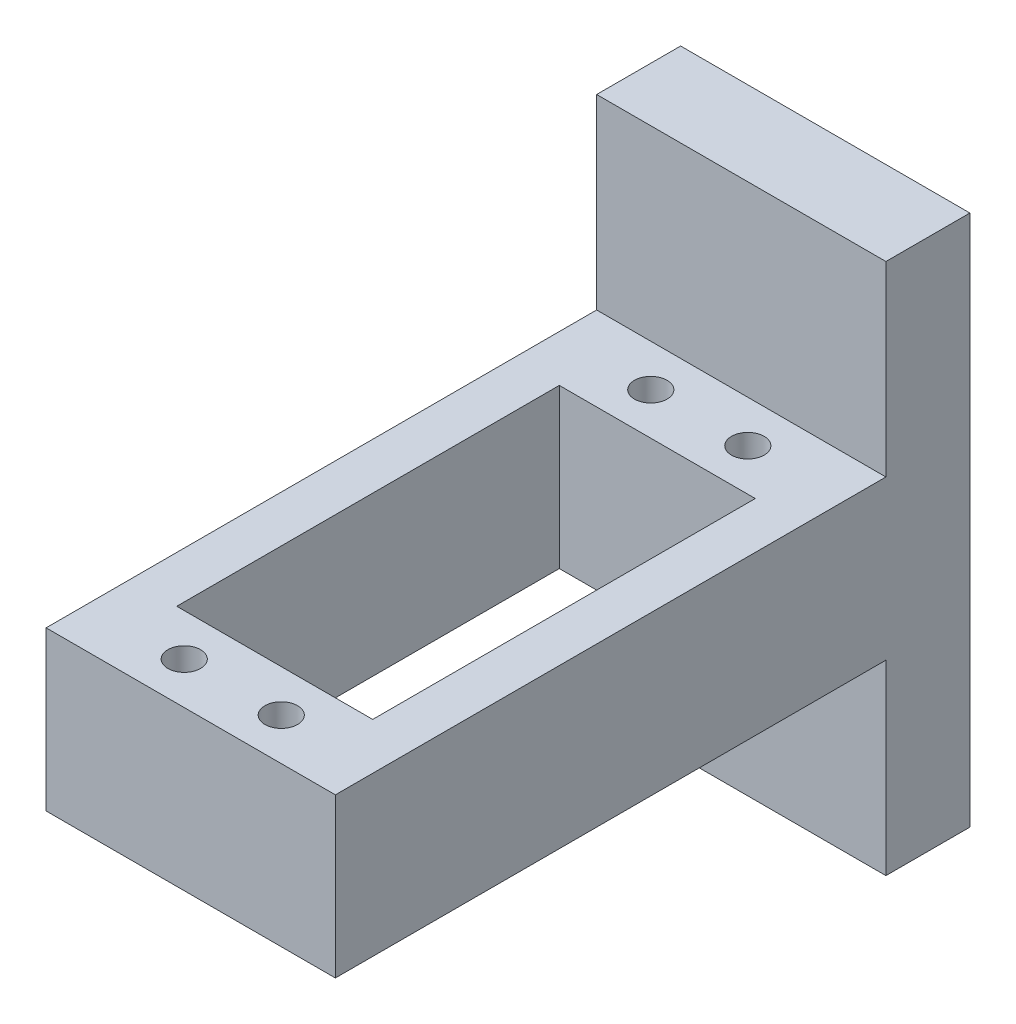
ISO-10303-21;
HEADER;
FILE_DESCRIPTION(('STEP AP214'),'2;1');
FILE_NAME('part.step','',(''),(''),'','','');
FILE_SCHEMA(('AUTOMOTIVE_DESIGN { 1 0 10303 214 1 1 1 1 }'));
ENDSEC;
DATA;
#1=APPLICATION_CONTEXT('core data for automotive mechanical design processes');
#2=APPLICATION_PROTOCOL_DEFINITION('international standard','automotive_design',2000,#1);
#3=PRODUCT_CONTEXT('',#1,'mechanical');
#4=PRODUCT('Part','Part','',(#3));
#5=PRODUCT_RELATED_PRODUCT_CATEGORY('part','',(#4));
#6=PRODUCT_DEFINITION_FORMATION('','',#4);
#7=PRODUCT_DEFINITION_CONTEXT('part definition',#1,'design');
#8=PRODUCT_DEFINITION('design','',#6,#7);
#9=PRODUCT_DEFINITION_SHAPE('','',#8);
#10=(LENGTH_UNIT() NAMED_UNIT(*) SI_UNIT(.MILLI.,.METRE.));
#11=(NAMED_UNIT(*) PLANE_ANGLE_UNIT() SI_UNIT($,.RADIAN.));
#12=(NAMED_UNIT(*) SI_UNIT($,.STERADIAN.) SOLID_ANGLE_UNIT());
#13=UNCERTAINTY_MEASURE_WITH_UNIT(LENGTH_MEASURE(1.E-05),#10,'distance_accuracy_value','');
#14=(GEOMETRIC_REPRESENTATION_CONTEXT(3) GLOBAL_UNCERTAINTY_ASSIGNED_CONTEXT((#13)) GLOBAL_UNIT_ASSIGNED_CONTEXT((#10,
#11,#12)) REPRESENTATION_CONTEXT('',''));
#15=CARTESIAN_POINT('',(0.,0.,0.));
#16=DIRECTION('',(0.,0.,1.));
#17=DIRECTION('',(1.,0.,0.));
#18=AXIS2_PLACEMENT_3D('',#15,#16,#17);
#19=CARTESIAN_POINT('',(0.,0.,9.));
#20=DIRECTION('',(0.,0.,1.));
#21=DIRECTION('',(1.,0.,0.));
#22=AXIS2_PLACEMENT_3D('',#19,#20,#21);
#23=PLANE('',#22);
#24=DIRECTION('',(-1.,0.,0.));
#25=VECTOR('',#24,1.);
#26=CARTESIAN_POINT('',(15.5,8.5,9.));
#27=LINE('',#26,#25);
#28=CARTESIAN_POINT('',(15.5,8.49999999999999,9.));
#29=VERTEX_POINT('',#28);
#30=CARTESIAN_POINT('',(-15.5,8.5,9.));
#31=VERTEX_POINT('',#30);
#32=EDGE_CURVE('E157',#29,#31,#27,.T.);
#33=ORIENTED_EDGE('',*,*,#32,.F.);
#34=DIRECTION('',(0.,1.,0.));
#35=VECTOR('',#34,1.);
#36=CARTESIAN_POINT('',(15.5,-28.5,9.));
#37=LINE('',#36,#35);
#38=CARTESIAN_POINT('',(15.5,28.5,9.));
#39=VERTEX_POINT('',#38);
#40=EDGE_CURVE('E185',#29,#39,#37,.T.);
#41=ORIENTED_EDGE('',*,*,#40,.T.);
#42=DIRECTION('',(-1.,0.,0.));
#43=VECTOR('',#42,1.);
#44=CARTESIAN_POINT('',(15.5,28.5,9.));
#45=LINE('',#44,#43);
#46=CARTESIAN_POINT('',(-15.5,28.5,9.));
#47=VERTEX_POINT('',#46);
#48=EDGE_CURVE('E188',#39,#47,#45,.T.);
#49=ORIENTED_EDGE('',*,*,#48,.T.);
#50=DIRECTION('',(0.,-1.,0.));
#51=VECTOR('',#50,1.);
#52=CARTESIAN_POINT('',(-15.5,10.3,9.));
#53=LINE('',#52,#51);
#54=EDGE_CURVE('E180',#47,#31,#53,.T.);
#55=ORIENTED_EDGE('',*,*,#54,.T.);
#56=EDGE_LOOP('',(#33,#41,#49,#55));
#57=FACE_BOUND('',#56,.T.);
#58=ADVANCED_FACE('F33',(#57),#23,.T.);
#59=CARTESIAN_POINT('',(-15.5,-28.5,9.));
#60=DIRECTION('',(1.,0.,0.));
#61=DIRECTION('',(0.,0.,-1.));
#62=AXIS2_PLACEMENT_3D('',#59,#60,#61);
#63=PLANE('',#62);
#64=DIRECTION('',(0.,-1.,0.));
#65=VECTOR('',#64,1.);
#66=CARTESIAN_POINT('',(-15.5,-28.5,0.));
#67=LINE('',#66,#65);
#68=CARTESIAN_POINT('',(-15.5,28.5,0.));
#69=VERTEX_POINT('',#68);
#70=CARTESIAN_POINT('',(-15.5,-28.5,0.));
#71=VERTEX_POINT('',#70);
#72=EDGE_CURVE('E179',#69,#71,#67,.T.);
#73=ORIENTED_EDGE('',*,*,#72,.T.);
#74=DIRECTION('',(0.,0.,-1.));
#75=VECTOR('',#74,1.);
#76=CARTESIAN_POINT('',(-15.5,-28.5,9.));
#77=LINE('',#76,#75);
#78=CARTESIAN_POINT('',(-15.5,-28.5,9.));
#79=VERTEX_POINT('',#78);
#80=EDGE_CURVE('E207',#79,#71,#77,.T.);
#81=ORIENTED_EDGE('',*,*,#80,.F.);
#82=CARTESIAN_POINT('',(-15.5,-8.5,9.));
#83=VERTEX_POINT('',#82);
#84=EDGE_CURVE('E183',#83,#79,#53,.T.);
#85=ORIENTED_EDGE('',*,*,#84,.F.);
#86=DIRECTION('',(0.,0.,-1.));
#87=VECTOR('',#86,1.);
#88=CARTESIAN_POINT('',(-15.5,-8.5,68.));
#89=LINE('',#88,#87);
#90=CARTESIAN_POINT('',(-15.5,-8.5,68.));
#91=VERTEX_POINT('',#90);
#92=EDGE_CURVE('E176',#91,#83,#89,.T.);
#93=ORIENTED_EDGE('',*,*,#92,.F.);
#94=DIRECTION('',(0.,-1.,0.));
#95=VECTOR('',#94,1.);
#96=CARTESIAN_POINT('',(-15.5,-8.5,68.));
#97=LINE('',#96,#95);
#98=CARTESIAN_POINT('',(-15.5,8.5,68.));
#99=VERTEX_POINT('',#98);
#100=EDGE_CURVE('E153',#99,#91,#97,.T.);
#101=ORIENTED_EDGE('',*,*,#100,.F.);
#102=DIRECTION('',(0.,0.,-1.));
#103=VECTOR('',#102,1.);
#104=CARTESIAN_POINT('',(-15.5,8.5,68.));
#105=LINE('',#104,#103);
#106=EDGE_CURVE('E163',#99,#31,#105,.T.);
#107=ORIENTED_EDGE('',*,*,#106,.T.);
#108=ORIENTED_EDGE('',*,*,#54,.F.);
#109=DIRECTION('',(0.,0.,-1.));
#110=VECTOR('',#109,1.);
#111=CARTESIAN_POINT('',(-15.5,28.5,9.));
#112=LINE('',#111,#110);
#113=EDGE_CURVE('E190',#47,#69,#112,.T.);
#114=ORIENTED_EDGE('',*,*,#113,.T.);
#115=EDGE_LOOP('',(#73,#81,#85,#93,#101,#107,#108,#114));
#116=FACE_BOUND('',#115,.T.);
#117=ADVANCED_FACE('F35',(#116),#63,.F.);
#118=CARTESIAN_POINT('',(15.5,-28.5,9.));
#119=DIRECTION('',(0.,1.,0.));
#120=DIRECTION('',(0.,0.,1.));
#121=AXIS2_PLACEMENT_3D('',#118,#119,#120);
#122=PLANE('',#121);
#123=DIRECTION('',(1.,0.,0.));
#124=VECTOR('',#123,1.);
#125=CARTESIAN_POINT('',(15.5,-28.5,0.));
#126=LINE('',#125,#124);
#127=CARTESIAN_POINT('',(15.5,-28.5,0.));
#128=VERTEX_POINT('',#127);
#129=EDGE_CURVE('E192',#71,#128,#126,.T.);
#130=ORIENTED_EDGE('',*,*,#129,.T.);
#131=DIRECTION('',(0.,0.,-1.));
#132=VECTOR('',#131,1.);
#133=CARTESIAN_POINT('',(15.5,-28.5,9.));
#134=LINE('',#133,#132);
#135=CARTESIAN_POINT('',(15.5,-28.5,9.));
#136=VERTEX_POINT('',#135);
#137=EDGE_CURVE('E204',#136,#128,#134,.T.);
#138=ORIENTED_EDGE('',*,*,#137,.F.);
#139=DIRECTION('',(1.,0.,0.));
#140=VECTOR('',#139,1.);
#141=CARTESIAN_POINT('',(15.5,-28.5,9.));
#142=LINE('',#141,#140);
#143=EDGE_CURVE('E182',#79,#136,#142,.T.);
#144=ORIENTED_EDGE('',*,*,#143,.F.);
#145=ORIENTED_EDGE('',*,*,#80,.T.);
#146=EDGE_LOOP('',(#130,#138,#144,#145));
#147=FACE_BOUND('',#146,.T.);
#148=ADVANCED_FACE('F311',(#147),#122,.F.);
#149=CARTESIAN_POINT('',(15.5,-28.5,9.));
#150=DIRECTION('',(-1.,0.,0.));
#151=DIRECTION('',(0.,0.,1.));
#152=AXIS2_PLACEMENT_3D('',#149,#150,#151);
#153=PLANE('',#152);
#154=DIRECTION('',(0.,1.,0.));
#155=VECTOR('',#154,1.);
#156=CARTESIAN_POINT('',(15.5,-28.5,0.));
#157=LINE('',#156,#155);
#158=CARTESIAN_POINT('',(15.5,28.5,0.));
#159=VERTEX_POINT('',#158);
#160=EDGE_CURVE('E194',#128,#159,#157,.T.);
#161=ORIENTED_EDGE('',*,*,#160,.T.);
#162=DIRECTION('',(0.,0.,-1.));
#163=VECTOR('',#162,1.);
#164=CARTESIAN_POINT('',(15.5,28.5,9.));
#165=LINE('',#164,#163);
#166=EDGE_CURVE('E201',#39,#159,#165,.T.);
#167=ORIENTED_EDGE('',*,*,#166,.F.);
#168=ORIENTED_EDGE('',*,*,#40,.F.);
#169=DIRECTION('',(0.,0.,-1.));
#170=VECTOR('',#169,1.);
#171=CARTESIAN_POINT('',(15.5,8.5,68.));
#172=LINE('',#171,#170);
#173=CARTESIAN_POINT('',(15.5,8.5,68.));
#174=VERTEX_POINT('',#173);
#175=EDGE_CURVE('E170',#174,#29,#172,.T.);
#176=ORIENTED_EDGE('',*,*,#175,.F.);
#177=DIRECTION('',(0.,1.,0.));
#178=VECTOR('',#177,1.);
#179=CARTESIAN_POINT('',(15.5,-8.5,68.));
#180=LINE('',#179,#178);
#181=CARTESIAN_POINT('',(15.5,-8.5,68.));
#182=VERTEX_POINT('',#181);
#183=EDGE_CURVE('E159',#182,#174,#180,.T.);
#184=ORIENTED_EDGE('',*,*,#183,.F.);
#185=DIRECTION('',(0.,0.,-1.));
#186=VECTOR('',#185,1.);
#187=CARTESIAN_POINT('',(15.5,-8.5,68.));
#188=LINE('',#187,#186);
#189=CARTESIAN_POINT('',(15.5,-8.5,9.));
#190=VERTEX_POINT('',#189);
#191=EDGE_CURVE('E173',#182,#190,#188,.T.);
#192=ORIENTED_EDGE('',*,*,#191,.T.);
#193=EDGE_CURVE('E186',#136,#190,#37,.T.);
#194=ORIENTED_EDGE('',*,*,#193,.F.);
#195=ORIENTED_EDGE('',*,*,#137,.T.);
#196=EDGE_LOOP('',(#161,#167,#168,#176,#184,#192,#194,#195));
#197=FACE_BOUND('',#196,.T.);
#198=ADVANCED_FACE('F306',(#197),#153,.F.);
#199=CARTESIAN_POINT('',(15.5,28.5,9.));
#200=DIRECTION('',(0.,-1.,0.));
#201=DIRECTION('',(0.,0.,-1.));
#202=AXIS2_PLACEMENT_3D('',#199,#200,#201);
#203=PLANE('',#202);
#204=DIRECTION('',(-1.,0.,0.));
#205=VECTOR('',#204,1.);
#206=CARTESIAN_POINT('',(15.5,28.5,0.));
#207=LINE('',#206,#205);
#208=EDGE_CURVE('E196',#159,#69,#207,.T.);
#209=ORIENTED_EDGE('',*,*,#208,.T.);
#210=ORIENTED_EDGE('',*,*,#113,.F.);
#211=ORIENTED_EDGE('',*,*,#48,.F.);
#212=ORIENTED_EDGE('',*,*,#166,.T.);
#213=EDGE_LOOP('',(#209,#210,#211,#212));
#214=FACE_BOUND('',#213,.T.);
#215=ADVANCED_FACE('F292',(#214),#203,.F.);
#216=DIRECTION('',(1.,0.,0.));
#217=VECTOR('',#216,1.);
#218=CARTESIAN_POINT('',(15.5,-8.5,9.));
#219=LINE('',#218,#217);
#220=EDGE_CURVE('E150',#83,#190,#219,.T.);
#221=ORIENTED_EDGE('',*,*,#220,.F.);
#222=ORIENTED_EDGE('',*,*,#84,.T.);
#223=ORIENTED_EDGE('',*,*,#143,.T.);
#224=ORIENTED_EDGE('',*,*,#193,.T.);
#225=EDGE_LOOP('',(#221,#222,#223,#224));
#226=FACE_BOUND('',#225,.T.);
#227=ADVANCED_FACE('F277',(#226),#23,.T.);
#228=CARTESIAN_POINT('',(0.,0.,0.));
#229=DIRECTION('',(0.,0.,1.));
#230=DIRECTION('',(1.,0.,0.));
#231=AXIS2_PLACEMENT_3D('',#228,#229,#230);
#232=PLANE('',#231);
#233=CARTESIAN_POINT('',(11.5,25.,0.));
#234=DIRECTION('',(0.,0.,-1.));
#235=DIRECTION('',(1.,0.,0.));
#236=AXIS2_PLACEMENT_3D('',#233,#234,#235);
#237=CIRCLE('',#236,1.75);
#238=CARTESIAN_POINT('',(13.25,25.,0.));
#239=VERTEX_POINT('',#238);
#240=EDGE_CURVE('E259',#239,#239,#237,.T.);
#241=ORIENTED_EDGE('',*,*,#240,.F.);
#242=EDGE_LOOP('',(#241));
#243=FACE_BOUND('',#242,.T.);
#244=CARTESIAN_POINT('',(-11.5,-25.,0.));
#245=DIRECTION('',(0.,0.,-1.));
#246=DIRECTION('',(1.,0.,0.));
#247=AXIS2_PLACEMENT_3D('',#244,#245,#246);
#248=CIRCLE('',#247,1.75);
#249=CARTESIAN_POINT('',(-9.75000000000002,-25.,0.));
#250=VERTEX_POINT('',#249);
#251=EDGE_CURVE('E253',#250,#250,#248,.T.);
#252=ORIENTED_EDGE('',*,*,#251,.F.);
#253=EDGE_LOOP('',(#252));
#254=FACE_BOUND('',#253,.T.);
#255=CARTESIAN_POINT('',(11.5,-25.,0.));
#256=DIRECTION('',(0.,0.,-1.));
#257=DIRECTION('',(-1.,0.,0.));
#258=AXIS2_PLACEMENT_3D('',#255,#256,#257);
#259=CIRCLE('',#258,1.75);
#260=CARTESIAN_POINT('',(9.74999999999998,-25.,0.));
#261=VERTEX_POINT('',#260);
#262=EDGE_CURVE('E247',#261,#261,#259,.T.);
#263=ORIENTED_EDGE('',*,*,#262,.F.);
#264=EDGE_LOOP('',(#263));
#265=FACE_BOUND('',#264,.T.);
#266=CARTESIAN_POINT('',(-11.5,25.,0.));
#267=DIRECTION('',(0.,0.,-1.));
#268=DIRECTION('',(-1.,0.,0.));
#269=AXIS2_PLACEMENT_3D('',#266,#267,#268);
#270=CIRCLE('',#269,1.75);
#271=CARTESIAN_POINT('',(-13.25,25.,0.));
#272=VERTEX_POINT('',#271);
#273=EDGE_CURVE('E241',#272,#272,#270,.T.);
#274=ORIENTED_EDGE('',*,*,#273,.F.);
#275=EDGE_LOOP('',(#274));
#276=FACE_BOUND('',#275,.T.);
#277=ORIENTED_EDGE('',*,*,#72,.F.);
#278=ORIENTED_EDGE('',*,*,#208,.F.);
#279=ORIENTED_EDGE('',*,*,#160,.F.);
#280=ORIENTED_EDGE('',*,*,#129,.F.);
#281=EDGE_LOOP('',(#277,#278,#279,#280));
#282=FACE_BOUND('',#281,.T.);
#283=ADVANCED_FACE('F274',(#243,#254,#265,#276,#282),#232,.F.);
#284=CARTESIAN_POINT('',(15.5,-8.5,68.));
#285=DIRECTION('',(0.,1.,0.));
#286=DIRECTION('',(0.,0.,1.));
#287=AXIS2_PLACEMENT_3D('',#284,#285,#286);
#288=PLANE('',#287);
#289=CARTESIAN_POINT('',(5.2,-8.5,13.5));
#290=DIRECTION('',(0.,-1.,0.));
#291=DIRECTION('',(0.,0.,-1.));
#292=AXIS2_PLACEMENT_3D('',#289,#290,#291);
#293=CIRCLE('',#292,1.75);
#294=CARTESIAN_POINT('',(5.2,-8.5,11.75));
#295=VERTEX_POINT('',#294);
#296=EDGE_CURVE('E219',#295,#295,#293,.T.);
#297=ORIENTED_EDGE('',*,*,#296,.F.);
#298=EDGE_LOOP('',(#297));
#299=FACE_BOUND('',#298,.T.);
#300=CARTESIAN_POINT('',(-5.2,-8.5,13.5));
#301=DIRECTION('',(0.,-1.,0.));
#302=DIRECTION('',(0.,0.,1.));
#303=AXIS2_PLACEMENT_3D('',#300,#301,#302);
#304=CIRCLE('',#303,1.75);
#305=CARTESIAN_POINT('',(-5.2,-8.5,15.25));
#306=VERTEX_POINT('',#305);
#307=EDGE_CURVE('E236',#306,#306,#304,.T.);
#308=ORIENTED_EDGE('',*,*,#307,.F.);
#309=EDGE_LOOP('',(#308));
#310=FACE_BOUND('',#309,.T.);
#311=CARTESIAN_POINT('',(5.2,-8.5,63.5));
#312=DIRECTION('',(0.,-1.,0.));
#313=DIRECTION('',(0.,0.,1.));
#314=AXIS2_PLACEMENT_3D('',#311,#312,#313);
#315=CIRCLE('',#314,1.75);
#316=CARTESIAN_POINT('',(5.2,-8.5,65.25));
#317=VERTEX_POINT('',#316);
#318=EDGE_CURVE('E232',#317,#317,#315,.T.);
#319=ORIENTED_EDGE('',*,*,#318,.F.);
#320=EDGE_LOOP('',(#319));
#321=FACE_BOUND('',#320,.T.);
#322=CARTESIAN_POINT('',(-5.2,-8.5,63.5));
#323=DIRECTION('',(0.,-1.,0.));
#324=DIRECTION('',(0.,0.,-1.));
#325=AXIS2_PLACEMENT_3D('',#322,#323,#324);
#326=CIRCLE('',#325,1.75);
#327=CARTESIAN_POINT('',(-5.2,-8.5,61.75));
#328=VERTEX_POINT('',#327);
#329=EDGE_CURVE('E229',#328,#328,#326,.T.);
#330=ORIENTED_EDGE('',*,*,#329,.F.);
#331=EDGE_LOOP('',(#330));
#332=FACE_BOUND('',#331,.T.);
#333=DIRECTION('',(-1.,0.,0.));
#334=VECTOR('',#333,1.);
#335=CARTESIAN_POINT('',(-10.5,-8.5,59.));
#336=LINE('',#335,#334);
#337=CARTESIAN_POINT('',(10.5,-8.5,59.));
#338=VERTEX_POINT('',#337);
#339=CARTESIAN_POINT('',(-10.5,-8.5,59.));
#340=VERTEX_POINT('',#339);
#341=EDGE_CURVE('E136',#338,#340,#336,.T.);
#342=ORIENTED_EDGE('',*,*,#341,.F.);
#343=DIRECTION('',(0.,0.,1.));
#344=VECTOR('',#343,1.);
#345=CARTESIAN_POINT('',(10.5,-8.5,18.));
#346=LINE('',#345,#344);
#347=CARTESIAN_POINT('',(10.5,-8.5,18.));
#348=VERTEX_POINT('',#347);
#349=EDGE_CURVE('E50',#348,#338,#346,.T.);
#350=ORIENTED_EDGE('',*,*,#349,.F.);
#351=DIRECTION('',(1.,0.,0.));
#352=VECTOR('',#351,1.);
#353=CARTESIAN_POINT('',(-10.5,-8.5,18.));
#354=LINE('',#353,#352);
#355=CARTESIAN_POINT('',(-10.5,-8.5,18.));
#356=VERTEX_POINT('',#355);
#357=EDGE_CURVE('E143',#356,#348,#354,.T.);
#358=ORIENTED_EDGE('',*,*,#357,.F.);
#359=DIRECTION('',(0.,0.,-1.));
#360=VECTOR('',#359,1.);
#361=CARTESIAN_POINT('',(-10.5,-8.5,18.));
#362=LINE('',#361,#360);
#363=EDGE_CURVE('E127',#340,#356,#362,.T.);
#364=ORIENTED_EDGE('',*,*,#363,.F.);
#365=EDGE_LOOP('',(#342,#350,#358,#364));
#366=FACE_BOUND('',#365,.T.);
#367=ORIENTED_EDGE('',*,*,#220,.T.);
#368=ORIENTED_EDGE('',*,*,#191,.F.);
#369=DIRECTION('',(1.,0.,0.));
#370=VECTOR('',#369,1.);
#371=CARTESIAN_POINT('',(15.5,-8.5,68.));
#372=LINE('',#371,#370);
#373=EDGE_CURVE('E156',#91,#182,#372,.T.);
#374=ORIENTED_EDGE('',*,*,#373,.F.);
#375=ORIENTED_EDGE('',*,*,#92,.T.);
#376=EDGE_LOOP('',(#367,#368,#374,#375));
#377=FACE_BOUND('',#376,.T.);
#378=ADVANCED_FACE('F140',(#299,#310,#321,#332,#366,#377),#288,.F.);
#379=CARTESIAN_POINT('',(15.5,8.5,68.));
#380=DIRECTION('',(0.,-1.,0.));
#381=DIRECTION('',(1.,0.,0.));
#382=AXIS2_PLACEMENT_3D('',#379,#380,#381);
#383=PLANE('',#382);
#384=CARTESIAN_POINT('',(5.2,8.5,13.5));
#385=DIRECTION('',(0.,-1.,0.));
#386=DIRECTION('',(1.,0.,0.));
#387=AXIS2_PLACEMENT_3D('',#384,#385,#386);
#388=CIRCLE('',#387,1.75);
#389=CARTESIAN_POINT('',(6.95,8.5,13.5));
#390=VERTEX_POINT('',#389);
#391=EDGE_CURVE('E37',#390,#390,#388,.T.);
#392=ORIENTED_EDGE('',*,*,#391,.T.);
#393=EDGE_LOOP('',(#392));
#394=FACE_BOUND('',#393,.T.);
#395=CARTESIAN_POINT('',(-5.2,8.5,13.5));
#396=DIRECTION('',(0.,-1.,0.));
#397=DIRECTION('',(1.,0.,0.));
#398=AXIS2_PLACEMENT_3D('',#395,#396,#397);
#399=CIRCLE('',#398,1.75);
#400=CARTESIAN_POINT('',(-3.45,8.5,13.5));
#401=VERTEX_POINT('',#400);
#402=EDGE_CURVE('E221',#401,#401,#399,.T.);
#403=ORIENTED_EDGE('',*,*,#402,.T.);
#404=EDGE_LOOP('',(#403));
#405=FACE_BOUND('',#404,.T.);
#406=CARTESIAN_POINT('',(5.2,8.5,63.5));
#407=DIRECTION('',(0.,-1.,0.));
#408=DIRECTION('',(1.,0.,0.));
#409=AXIS2_PLACEMENT_3D('',#406,#407,#408);
#410=CIRCLE('',#409,1.75);
#411=CARTESIAN_POINT('',(6.95,8.5,63.5));
#412=VERTEX_POINT('',#411);
#413=EDGE_CURVE('E218',#412,#412,#410,.T.);
#414=ORIENTED_EDGE('',*,*,#413,.T.);
#415=EDGE_LOOP('',(#414));
#416=FACE_BOUND('',#415,.T.);
#417=CARTESIAN_POINT('',(-5.2,8.5,63.5));
#418=DIRECTION('',(0.,-1.,0.));
#419=DIRECTION('',(1.,0.,0.));
#420=AXIS2_PLACEMENT_3D('',#417,#418,#419);
#421=CIRCLE('',#420,1.75);
#422=CARTESIAN_POINT('',(-3.45,8.5,63.5));
#423=VERTEX_POINT('',#422);
#424=EDGE_CURVE('E215',#423,#423,#421,.T.);
#425=ORIENTED_EDGE('',*,*,#424,.T.);
#426=EDGE_LOOP('',(#425));
#427=FACE_BOUND('',#426,.T.);
#428=DIRECTION('',(1.,0.,0.));
#429=VECTOR('',#428,1.);
#430=CARTESIAN_POINT('',(15.5,8.5,18.));
#431=LINE('',#430,#429);
#432=CARTESIAN_POINT('',(-10.5,8.5,18.));
#433=VERTEX_POINT('',#432);
#434=CARTESIAN_POINT('',(10.5,8.5,18.));
#435=VERTEX_POINT('',#434);
#436=EDGE_CURVE('E42',#433,#435,#431,.T.);
#437=ORIENTED_EDGE('',*,*,#436,.T.);
#438=DIRECTION('',(0.,0.,1.));
#439=VECTOR('',#438,1.);
#440=CARTESIAN_POINT('',(10.5,8.5,68.));
#441=LINE('',#440,#439);
#442=CARTESIAN_POINT('',(10.5,8.5,59.));
#443=VERTEX_POINT('',#442);
#444=EDGE_CURVE('E11',#435,#443,#441,.T.);
#445=ORIENTED_EDGE('',*,*,#444,.T.);
#446=DIRECTION('',(-1.,0.,0.));
#447=VECTOR('',#446,1.);
#448=CARTESIAN_POINT('',(15.5,8.5,59.));
#449=LINE('',#448,#447);
#450=CARTESIAN_POINT('',(-10.5,8.5,59.));
#451=VERTEX_POINT('',#450);
#452=EDGE_CURVE('E210',#443,#451,#449,.T.);
#453=ORIENTED_EDGE('',*,*,#452,.T.);
#454=DIRECTION('',(0.,0.,-1.));
#455=VECTOR('',#454,1.);
#456=CARTESIAN_POINT('',(-10.5,8.5,68.));
#457=LINE('',#456,#455);
#458=EDGE_CURVE('E130',#451,#433,#457,.T.);
#459=ORIENTED_EDGE('',*,*,#458,.T.);
#460=EDGE_LOOP('',(#437,#445,#453,#459));
#461=FACE_BOUND('',#460,.T.);
#462=ORIENTED_EDGE('',*,*,#32,.T.);
#463=ORIENTED_EDGE('',*,*,#106,.F.);
#464=DIRECTION('',(-1.,0.,0.));
#465=VECTOR('',#464,1.);
#466=CARTESIAN_POINT('',(15.5,8.5,68.));
#467=LINE('',#466,#465);
#468=EDGE_CURVE('E161',#174,#99,#467,.T.);
#469=ORIENTED_EDGE('',*,*,#468,.F.);
#470=ORIENTED_EDGE('',*,*,#175,.T.);
#471=EDGE_LOOP('',(#462,#463,#469,#470));
#472=FACE_BOUND('',#471,.T.);
#473=ADVANCED_FACE('F301',(#394,#405,#416,#427,#461,#472),#383,.F.);
#474=CARTESIAN_POINT('',(0.,0.,68.));
#475=DIRECTION('',(0.,0.,1.));
#476=DIRECTION('',(1.,0.,0.));
#477=AXIS2_PLACEMENT_3D('',#474,#475,#476);
#478=PLANE('',#477);
#479=ORIENTED_EDGE('',*,*,#100,.T.);
#480=ORIENTED_EDGE('',*,*,#373,.T.);
#481=ORIENTED_EDGE('',*,*,#183,.T.);
#482=ORIENTED_EDGE('',*,*,#468,.T.);
#483=EDGE_LOOP('',(#479,#480,#481,#482));
#484=FACE_BOUND('',#483,.T.);
#485=ADVANCED_FACE('F317',(#484),#478,.T.);
#486=CARTESIAN_POINT('',(10.5,28.5,18.));
#487=DIRECTION('',(1.,0.,0.));
#488=DIRECTION('',(0.,0.,-1.));
#489=AXIS2_PLACEMENT_3D('',#486,#487,#488);
#490=PLANE('',#489);
#491=DIRECTION('',(0.,-1.,0.));
#492=VECTOR('',#491,1.);
#493=CARTESIAN_POINT('',(10.5,28.5,18.));
#494=LINE('',#493,#492);
#495=EDGE_CURVE('E148',#435,#348,#494,.T.);
#496=ORIENTED_EDGE('',*,*,#495,.T.);
#497=ORIENTED_EDGE('',*,*,#349,.T.);
#498=DIRECTION('',(0.,-1.,0.));
#499=VECTOR('',#498,1.);
#500=CARTESIAN_POINT('',(10.5,28.5,59.));
#501=LINE('',#500,#499);
#502=EDGE_CURVE('E133',#443,#338,#501,.T.);
#503=ORIENTED_EDGE('',*,*,#502,.F.);
#504=ORIENTED_EDGE('',*,*,#444,.F.);
#505=EDGE_LOOP('',(#496,#497,#503,#504));
#506=FACE_BOUND('',#505,.T.);
#507=ADVANCED_FACE('F319',(#506),#490,.F.);
#508=CARTESIAN_POINT('',(-10.5,28.5,18.));
#509=DIRECTION('',(0.,0.,-1.));
#510=DIRECTION('',(-1.,0.,0.));
#511=AXIS2_PLACEMENT_3D('',#508,#509,#510);
#512=PLANE('',#511);
#513=DIRECTION('',(0.,-1.,0.));
#514=VECTOR('',#513,1.);
#515=CARTESIAN_POINT('',(-10.5,28.5,18.));
#516=LINE('',#515,#514);
#517=EDGE_CURVE('E132',#433,#356,#516,.T.);
#518=ORIENTED_EDGE('',*,*,#517,.T.);
#519=ORIENTED_EDGE('',*,*,#357,.T.);
#520=ORIENTED_EDGE('',*,*,#495,.F.);
#521=ORIENTED_EDGE('',*,*,#436,.F.);
#522=EDGE_LOOP('',(#518,#519,#520,#521));
#523=FACE_BOUND('',#522,.T.);
#524=ADVANCED_FACE('F325',(#523),#512,.F.);
#525=CARTESIAN_POINT('',(-10.5,28.5,18.));
#526=DIRECTION('',(-1.,0.,0.));
#527=DIRECTION('',(0.,0.,1.));
#528=AXIS2_PLACEMENT_3D('',#525,#526,#527);
#529=PLANE('',#528);
#530=DIRECTION('',(0.,-1.,0.));
#531=VECTOR('',#530,1.);
#532=CARTESIAN_POINT('',(-10.5,28.5,59.));
#533=LINE('',#532,#531);
#534=EDGE_CURVE('E58',#451,#340,#533,.T.);
#535=ORIENTED_EDGE('',*,*,#534,.T.);
#536=ORIENTED_EDGE('',*,*,#363,.T.);
#537=ORIENTED_EDGE('',*,*,#517,.F.);
#538=ORIENTED_EDGE('',*,*,#458,.F.);
#539=EDGE_LOOP('',(#535,#536,#537,#538));
#540=FACE_BOUND('',#539,.T.);
#541=ADVANCED_FACE('F124',(#540),#529,.F.);
#542=CARTESIAN_POINT('',(-10.5,28.5,59.));
#543=DIRECTION('',(0.,0.,1.));
#544=DIRECTION('',(1.,0.,0.));
#545=AXIS2_PLACEMENT_3D('',#542,#543,#544);
#546=PLANE('',#545);
#547=ORIENTED_EDGE('',*,*,#502,.T.);
#548=ORIENTED_EDGE('',*,*,#341,.T.);
#549=ORIENTED_EDGE('',*,*,#534,.F.);
#550=ORIENTED_EDGE('',*,*,#452,.F.);
#551=EDGE_LOOP('',(#547,#548,#549,#550));
#552=FACE_BOUND('',#551,.T.);
#553=ADVANCED_FACE('F137',(#552),#546,.F.);
#554=CARTESIAN_POINT('',(-5.2,28.5,63.5));
#555=DIRECTION('',(0.,-1.,0.));
#556=DIRECTION('',(0.,0.,-1.));
#557=AXIS2_PLACEMENT_3D('',#554,#555,#556);
#558=CYLINDRICAL_SURFACE('',#557,1.75);
#559=ORIENTED_EDGE('',*,*,#329,.T.);
#560=EDGE_LOOP('',(#559));
#561=FACE_BOUND('',#560,.T.);
#562=ORIENTED_EDGE('',*,*,#424,.F.);
#563=EDGE_LOOP('',(#562));
#564=FACE_BOUND('',#563,.T.);
#565=ADVANCED_FACE('F411',(#561,#564),#558,.F.);
#566=CARTESIAN_POINT('',(5.2,28.5,63.5));
#567=DIRECTION('',(0.,-1.,0.));
#568=DIRECTION('',(0.,0.,-1.));
#569=AXIS2_PLACEMENT_3D('',#566,#567,#568);
#570=CYLINDRICAL_SURFACE('',#569,1.75);
#571=ORIENTED_EDGE('',*,*,#318,.T.);
#572=EDGE_LOOP('',(#571));
#573=FACE_BOUND('',#572,.T.);
#574=ORIENTED_EDGE('',*,*,#413,.F.);
#575=EDGE_LOOP('',(#574));
#576=FACE_BOUND('',#575,.T.);
#577=ADVANCED_FACE('F420',(#573,#576),#570,.F.);
#578=CARTESIAN_POINT('',(-5.2,28.5,13.5));
#579=DIRECTION('',(0.,-1.,0.));
#580=DIRECTION('',(0.,0.,-1.));
#581=AXIS2_PLACEMENT_3D('',#578,#579,#580);
#582=CYLINDRICAL_SURFACE('',#581,1.75);
#583=ORIENTED_EDGE('',*,*,#307,.T.);
#584=EDGE_LOOP('',(#583));
#585=FACE_BOUND('',#584,.T.);
#586=ORIENTED_EDGE('',*,*,#402,.F.);
#587=EDGE_LOOP('',(#586));
#588=FACE_BOUND('',#587,.T.);
#589=ADVANCED_FACE('F430',(#585,#588),#582,.F.);
#590=CARTESIAN_POINT('',(5.2,28.5,13.5));
#591=DIRECTION('',(0.,-1.,0.));
#592=DIRECTION('',(0.,0.,-1.));
#593=AXIS2_PLACEMENT_3D('',#590,#591,#592);
#594=CYLINDRICAL_SURFACE('',#593,1.75);
#595=ORIENTED_EDGE('',*,*,#296,.T.);
#596=EDGE_LOOP('',(#595));
#597=FACE_BOUND('',#596,.T.);
#598=ORIENTED_EDGE('',*,*,#391,.F.);
#599=EDGE_LOOP('',(#598));
#600=FACE_BOUND('',#599,.T.);
#601=ADVANCED_FACE('F440',(#597,#600),#594,.F.);
#602=CARTESIAN_POINT('',(-11.5,25.,3.));
#603=DIRECTION('',(0.,0.,-1.));
#604=DIRECTION('',(-1.,0.,0.));
#605=AXIS2_PLACEMENT_3D('',#602,#603,#604);
#606=CYLINDRICAL_SURFACE('',#605,1.75);
#607=CARTESIAN_POINT('',(-11.5,25.,3.));
#608=DIRECTION('',(0.,0.,-1.));
#609=DIRECTION('',(-1.,0.,0.));
#610=AXIS2_PLACEMENT_3D('',#607,#608,#609);
#611=CIRCLE('',#610,1.75);
#612=CARTESIAN_POINT('',(-13.25,25.,3.));
#613=VERTEX_POINT('',#612);
#614=EDGE_CURVE('E233',#613,#613,#611,.T.);
#615=ORIENTED_EDGE('',*,*,#614,.F.);
#616=EDGE_LOOP('',(#615));
#617=FACE_BOUND('',#616,.T.);
#618=ORIENTED_EDGE('',*,*,#273,.T.);
#619=EDGE_LOOP('',(#618));
#620=FACE_BOUND('',#619,.T.);
#621=ADVANCED_FACE('F450',(#617,#620),#606,.F.);
#622=CARTESIAN_POINT('',(-11.5,25.,3.));
#623=DIRECTION('',(0.,0.,-1.));
#624=DIRECTION('',(-1.,0.,0.));
#625=AXIS2_PLACEMENT_3D('',#622,#623,#624);
#626=PLANE('',#625);
#627=ORIENTED_EDGE('',*,*,#614,.T.);
#628=EDGE_LOOP('',(#627));
#629=FACE_BOUND('',#628,.T.);
#630=ADVANCED_FACE('F466',(#629),#626,.T.);
#631=CARTESIAN_POINT('',(11.5,-25.,3.));
#632=DIRECTION('',(0.,0.,-1.));
#633=DIRECTION('',(-1.,0.,0.));
#634=AXIS2_PLACEMENT_3D('',#631,#632,#633);
#635=CYLINDRICAL_SURFACE('',#634,1.75);
#636=CARTESIAN_POINT('',(11.5,-25.,3.));
#637=DIRECTION('',(0.,0.,-1.));
#638=DIRECTION('',(-1.,0.,0.));
#639=AXIS2_PLACEMENT_3D('',#636,#637,#638);
#640=CIRCLE('',#639,1.75);
#641=CARTESIAN_POINT('',(9.74999999999998,-25.,3.));
#642=VERTEX_POINT('',#641);
#643=EDGE_CURVE('E250',#642,#642,#640,.T.);
#644=ORIENTED_EDGE('',*,*,#643,.F.);
#645=EDGE_LOOP('',(#644));
#646=FACE_BOUND('',#645,.T.);
#647=ORIENTED_EDGE('',*,*,#262,.T.);
#648=EDGE_LOOP('',(#647));
#649=FACE_BOUND('',#648,.T.);
#650=ADVANCED_FACE('F476',(#646,#649),#635,.F.);
#651=CARTESIAN_POINT('',(11.5,-25.,3.));
#652=DIRECTION('',(0.,0.,-1.));
#653=DIRECTION('',(-1.,0.,0.));
#654=AXIS2_PLACEMENT_3D('',#651,#652,#653);
#655=PLANE('',#654);
#656=ORIENTED_EDGE('',*,*,#643,.T.);
#657=EDGE_LOOP('',(#656));
#658=FACE_BOUND('',#657,.T.);
#659=ADVANCED_FACE('F486',(#658),#655,.T.);
#660=CARTESIAN_POINT('',(-11.5,-25.,3.));
#661=DIRECTION('',(0.,0.,-1.));
#662=DIRECTION('',(-1.,0.,0.));
#663=AXIS2_PLACEMENT_3D('',#660,#661,#662);
#664=CYLINDRICAL_SURFACE('',#663,1.75);
#665=CARTESIAN_POINT('',(-11.5,-25.,3.));
#666=DIRECTION('',(0.,0.,-1.));
#667=DIRECTION('',(1.,0.,0.));
#668=AXIS2_PLACEMENT_3D('',#665,#666,#667);
#669=CIRCLE('',#668,1.75);
#670=CARTESIAN_POINT('',(-9.75000000000002,-25.,3.));
#671=VERTEX_POINT('',#670);
#672=EDGE_CURVE('E256',#671,#671,#669,.T.);
#673=ORIENTED_EDGE('',*,*,#672,.F.);
#674=EDGE_LOOP('',(#673));
#675=FACE_BOUND('',#674,.T.);
#676=ORIENTED_EDGE('',*,*,#251,.T.);
#677=EDGE_LOOP('',(#676));
#678=FACE_BOUND('',#677,.T.);
#679=ADVANCED_FACE('F496',(#675,#678),#664,.F.);
#680=CARTESIAN_POINT('',(-11.5,-25.,3.));
#681=DIRECTION('',(0.,0.,1.));
#682=DIRECTION('',(1.,0.,0.));
#683=AXIS2_PLACEMENT_3D('',#680,#681,#682);
#684=PLANE('',#683);
#685=ORIENTED_EDGE('',*,*,#672,.T.);
#686=EDGE_LOOP('',(#685));
#687=FACE_BOUND('',#686,.T.);
#688=ADVANCED_FACE('F270',(#687),#684,.F.);
#689=CARTESIAN_POINT('',(11.5,25.,3.));
#690=DIRECTION('',(0.,0.,-1.));
#691=DIRECTION('',(-1.,0.,0.));
#692=AXIS2_PLACEMENT_3D('',#689,#690,#691);
#693=CYLINDRICAL_SURFACE('',#692,1.75);
#694=CARTESIAN_POINT('',(11.5,25.,3.));
#695=DIRECTION('',(0.,0.,-1.));
#696=DIRECTION('',(1.,0.,0.));
#697=AXIS2_PLACEMENT_3D('',#694,#695,#696);
#698=CIRCLE('',#697,1.75);
#699=CARTESIAN_POINT('',(13.25,25.,3.));
#700=VERTEX_POINT('',#699);
#701=EDGE_CURVE('E244',#700,#700,#698,.T.);
#702=ORIENTED_EDGE('',*,*,#701,.F.);
#703=EDGE_LOOP('',(#702));
#704=FACE_BOUND('',#703,.T.);
#705=ORIENTED_EDGE('',*,*,#240,.T.);
#706=EDGE_LOOP('',(#705));
#707=FACE_BOUND('',#706,.T.);
#708=ADVANCED_FACE('F267',(#704,#707),#693,.F.);
#709=CARTESIAN_POINT('',(11.5,25.,3.));
#710=DIRECTION('',(0.,0.,1.));
#711=DIRECTION('',(1.,0.,0.));
#712=AXIS2_PLACEMENT_3D('',#709,#710,#711);
#713=PLANE('',#712);
#714=ORIENTED_EDGE('',*,*,#701,.T.);
#715=EDGE_LOOP('',(#714));
#716=FACE_BOUND('',#715,.T.);
#717=ADVANCED_FACE('F265',(#716),#713,.F.);
#718=CLOSED_SHELL('',(#58,#117,#148,#198,#215,#227,#283,#378,#473,#485,#507,#524,#541,#553,#565,
#577,#589,#601,#621,#630,#650,#659,#679,#688,#708,#717));
#719=MANIFOLD_SOLID_BREP('B2',#718);
#720=ADVANCED_BREP_SHAPE_REPRESENTATION('',(#18,#719),#14);
#721=SHAPE_DEFINITION_REPRESENTATION(#9,#720);
ENDSEC;
END-ISO-10303-21;
